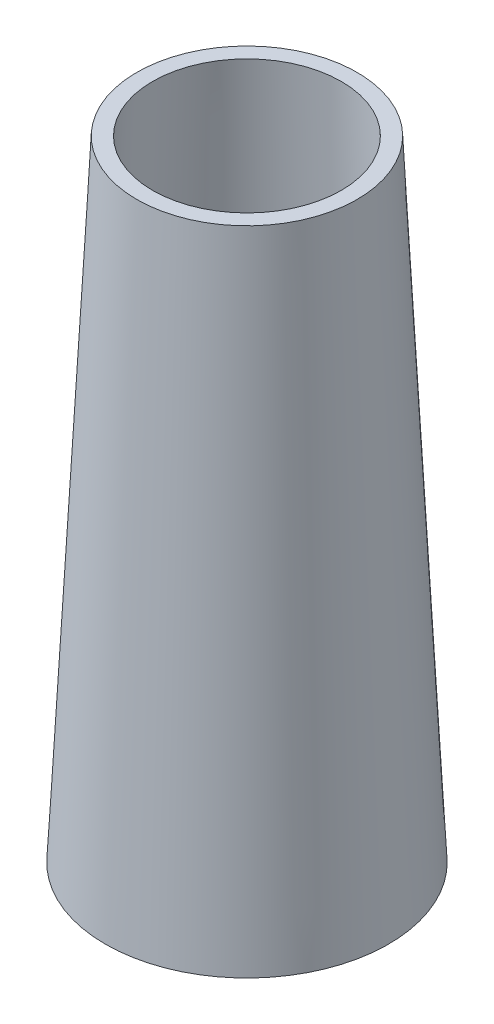
ISO-10303-21;
HEADER;
FILE_DESCRIPTION(('STEP AP214'),'2;1');
FILE_NAME('part.step','',(''),(''),'','','');
FILE_SCHEMA(('AUTOMOTIVE_DESIGN { 1 0 10303 214 1 1 1 1 }'));
ENDSEC;
DATA;
#1=APPLICATION_CONTEXT('core data for automotive mechanical design processes');
#2=APPLICATION_PROTOCOL_DEFINITION('international standard','automotive_design',2000,#1);
#3=PRODUCT_CONTEXT('',#1,'mechanical');
#4=PRODUCT('Part','Part','',(#3));
#5=PRODUCT_RELATED_PRODUCT_CATEGORY('part','',(#4));
#6=PRODUCT_DEFINITION_FORMATION('','',#4);
#7=PRODUCT_DEFINITION_CONTEXT('part definition',#1,'design');
#8=PRODUCT_DEFINITION('design','',#6,#7);
#9=PRODUCT_DEFINITION_SHAPE('','',#8);
#10=(LENGTH_UNIT() NAMED_UNIT(*) SI_UNIT(.MILLI.,.METRE.));
#11=(NAMED_UNIT(*) PLANE_ANGLE_UNIT() SI_UNIT($,.RADIAN.));
#12=(NAMED_UNIT(*) SI_UNIT($,.STERADIAN.) SOLID_ANGLE_UNIT());
#13=UNCERTAINTY_MEASURE_WITH_UNIT(LENGTH_MEASURE(1.E-05),#10,'distance_accuracy_value','');
#14=(GEOMETRIC_REPRESENTATION_CONTEXT(3) GLOBAL_UNCERTAINTY_ASSIGNED_CONTEXT((#13)) GLOBAL_UNIT_ASSIGNED_CONTEXT((#10,
#11,#12)) REPRESENTATION_CONTEXT('',''));
#15=CARTESIAN_POINT('',(0.,0.,0.));
#16=DIRECTION('',(0.,0.,1.));
#17=DIRECTION('',(1.,0.,0.));
#18=AXIS2_PLACEMENT_3D('',#15,#16,#17);
#19=CARTESIAN_POINT('',(0.,0.,0.));
#20=DIRECTION('',(0.,1.,0.));
#21=DIRECTION('',(0.,0.,1.));
#22=AXIS2_PLACEMENT_3D('',#19,#20,#21);
#23=PLANE('',#22);
#24=CARTESIAN_POINT('',(0.,0.,0.));
#25=DIRECTION('',(0.,1.,0.));
#26=DIRECTION('',(0.,0.,1.));
#27=AXIS2_PLACEMENT_3D('',#24,#25,#26);
#28=CIRCLE('',#27,22.5031230493126);
#29=CARTESIAN_POINT('',(0.,0.,22.5031230493126));
#30=VERTEX_POINT('',#29);
#31=EDGE_CURVE('E44',#30,#30,#28,.T.);
#32=ORIENTED_EDGE('',*,*,#31,.F.);
#33=EDGE_LOOP('',(#32));
#34=FACE_BOUND('',#33,.T.);
#35=CARTESIAN_POINT('',(0.,0.,0.));
#36=DIRECTION('',(0.,1.,0.));
#37=DIRECTION('',(0.,0.,1.));
#38=AXIS2_PLACEMENT_3D('',#35,#36,#37);
#39=CIRCLE('',#38,20.);
#40=CARTESIAN_POINT('',(0.,0.,20.));
#41=VERTEX_POINT('',#40);
#42=EDGE_CURVE('E52',#41,#41,#39,.T.);
#43=ORIENTED_EDGE('',*,*,#42,.T.);
#44=EDGE_LOOP('',(#43));
#45=FACE_BOUND('',#44,.T.);
#46=ADVANCED_FACE('F37',(#34,#45),#23,.F.);
#47=CARTESIAN_POINT('',(0.,100.,0.));
#48=DIRECTION('',(0.,1.,0.));
#49=DIRECTION('',(0.,0.,1.));
#50=AXIS2_PLACEMENT_3D('',#47,#48,#49);
#51=PLANE('',#50);
#52=CARTESIAN_POINT('',(0.,100.,0.));
#53=DIRECTION('',(0.,1.,0.));
#54=DIRECTION('',(0.,0.,1.));
#55=AXIS2_PLACEMENT_3D('',#52,#53,#54);
#56=CIRCLE('',#55,15.);
#57=CARTESIAN_POINT('',(0.,100.,15.));
#58=VERTEX_POINT('',#57);
#59=EDGE_CURVE('E48',#58,#58,#56,.T.);
#60=ORIENTED_EDGE('',*,*,#59,.F.);
#61=EDGE_LOOP('',(#60));
#62=FACE_BOUND('',#61,.T.);
#63=CARTESIAN_POINT('',(0.,100.,0.));
#64=DIRECTION('',(0.,1.,0.));
#65=DIRECTION('',(0.,0.,1.));
#66=AXIS2_PLACEMENT_3D('',#63,#64,#65);
#67=CIRCLE('',#66,17.5031230493126);
#68=CARTESIAN_POINT('',(0.,100.,17.5031230493126));
#69=VERTEX_POINT('',#68);
#70=EDGE_CURVE('E11',#69,#69,#67,.T.);
#71=ORIENTED_EDGE('',*,*,#70,.T.);
#72=EDGE_LOOP('',(#71));
#73=FACE_BOUND('',#72,.T.);
#74=ADVANCED_FACE('F65',(#62,#73),#51,.T.);
#75=CARTESIAN_POINT('',(0.,100.12484404236,0.));
#76=DIRECTION('',(0.,-1.,0.));
#77=DIRECTION('',(0.,0.,-1.));
#78=AXIS2_PLACEMENT_3D('',#75,#76,#77);
#79=CONICAL_SURFACE('',#78,17.4968808471946,0.0499583957219427);
#80=ORIENTED_EDGE('',*,*,#31,.T.);
#81=EDGE_LOOP('',(#80));
#82=FACE_BOUND('',#81,.T.);
#83=ORIENTED_EDGE('',*,*,#70,.F.);
#84=EDGE_LOOP('',(#83));
#85=FACE_BOUND('',#84,.T.);
#86=ADVANCED_FACE('F39',(#82,#85),#79,.T.);
#87=CARTESIAN_POINT('',(0.,100.,0.));
#88=DIRECTION('',(0.,-1.,0.));
#89=DIRECTION('',(0.,0.,-1.));
#90=AXIS2_PLACEMENT_3D('',#87,#88,#89);
#91=CONICAL_SURFACE('',#90,15.,0.0499583957219427);
#92=ORIENTED_EDGE('',*,*,#42,.F.);
#93=EDGE_LOOP('',(#92));
#94=FACE_BOUND('',#93,.T.);
#95=ORIENTED_EDGE('',*,*,#59,.T.);
#96=EDGE_LOOP('',(#95));
#97=FACE_BOUND('',#96,.T.);
#98=ADVANCED_FACE('F59',(#94,#97),#91,.F.);
#99=CLOSED_SHELL('',(#46,#74,#86,#98));
#100=MANIFOLD_SOLID_BREP('B2',#99);
#101=ADVANCED_BREP_SHAPE_REPRESENTATION('',(#18,#100),#14);
#102=SHAPE_DEFINITION_REPRESENTATION(#9,#101);
ENDSEC;
END-ISO-10303-21;
